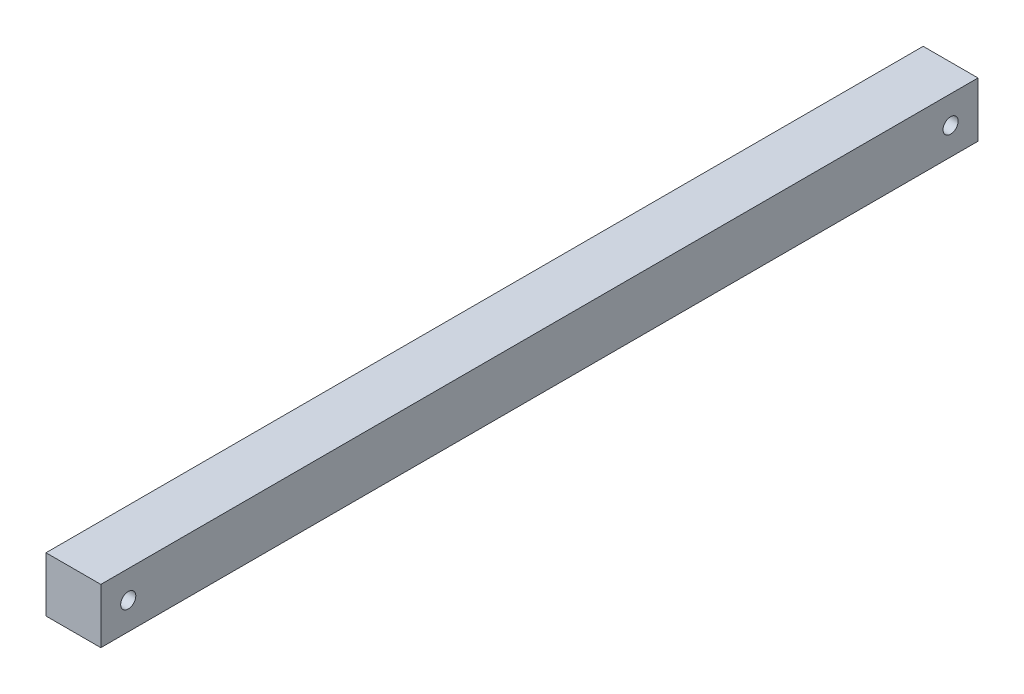
ISO-10303-21;
HEADER;
FILE_DESCRIPTION(('STEP AP214'),'2;1');
FILE_NAME('part.step','',(''),(''),'','','');
FILE_SCHEMA(('AUTOMOTIVE_DESIGN { 1 0 10303 214 1 1 1 1 }'));
ENDSEC;
DATA;
#1=APPLICATION_CONTEXT('core data for automotive mechanical design processes');
#2=APPLICATION_PROTOCOL_DEFINITION('international standard','automotive_design',2000,#1);
#3=PRODUCT_CONTEXT('',#1,'mechanical');
#4=PRODUCT('Part','Part','',(#3));
#5=PRODUCT_RELATED_PRODUCT_CATEGORY('part','',(#4));
#6=PRODUCT_DEFINITION_FORMATION('','',#4);
#7=PRODUCT_DEFINITION_CONTEXT('part definition',#1,'design');
#8=PRODUCT_DEFINITION('design','',#6,#7);
#9=PRODUCT_DEFINITION_SHAPE('','',#8);
#10=(LENGTH_UNIT() NAMED_UNIT(*) SI_UNIT(.MILLI.,.METRE.));
#11=(NAMED_UNIT(*) PLANE_ANGLE_UNIT() SI_UNIT($,.RADIAN.));
#12=(NAMED_UNIT(*) SI_UNIT($,.STERADIAN.) SOLID_ANGLE_UNIT());
#13=UNCERTAINTY_MEASURE_WITH_UNIT(LENGTH_MEASURE(1.E-05),#10,'distance_accuracy_value','');
#14=(GEOMETRIC_REPRESENTATION_CONTEXT(3) GLOBAL_UNCERTAINTY_ASSIGNED_CONTEXT((#13)) GLOBAL_UNIT_ASSIGNED_CONTEXT((#10,
#11,#12)) REPRESENTATION_CONTEXT('',''));
#15=CARTESIAN_POINT('',(0.,0.,0.));
#16=DIRECTION('',(0.,0.,1.));
#17=DIRECTION('',(1.,0.,0.));
#18=AXIS2_PLACEMENT_3D('',#15,#16,#17);
#19=CARTESIAN_POINT('',(12.7,-12.7,406.4));
#20=DIRECTION('',(-1.,0.,0.));
#21=DIRECTION('',(0.,0.,1.));
#22=AXIS2_PLACEMENT_3D('',#19,#20,#21);
#23=PLANE('',#22);
#24=CARTESIAN_POINT('',(12.7,0.,393.7));
#25=DIRECTION('',(-1.,0.,0.));
#26=DIRECTION('',(0.,0.,1.));
#27=AXIS2_PLACEMENT_3D('',#24,#25,#26);
#28=CIRCLE('',#27,3.50000000000002);
#29=CARTESIAN_POINT('',(12.7,0.,397.2));
#30=VERTEX_POINT('',#29);
#31=EDGE_CURVE('E111',#30,#30,#28,.T.);
#32=ORIENTED_EDGE('',*,*,#31,.T.);
#33=EDGE_LOOP('',(#32));
#34=FACE_BOUND('',#33,.T.);
#35=CARTESIAN_POINT('',(12.7,0.,12.7));
#36=DIRECTION('',(-1.,0.,0.));
#37=DIRECTION('',(0.,0.,-1.));
#38=AXIS2_PLACEMENT_3D('',#35,#36,#37);
#39=CIRCLE('',#38,3.50000000000003);
#40=CARTESIAN_POINT('',(12.7,0.,9.19999999999996));
#41=VERTEX_POINT('',#40);
#42=EDGE_CURVE('E132',#41,#41,#39,.T.);
#43=ORIENTED_EDGE('',*,*,#42,.T.);
#44=EDGE_LOOP('',(#43));
#45=FACE_BOUND('',#44,.T.);
#46=DIRECTION('',(0.,1.,0.));
#47=VECTOR('',#46,1.);
#48=CARTESIAN_POINT('',(12.7,-12.7,0.));
#49=LINE('',#48,#47);
#50=CARTESIAN_POINT('',(12.7,-12.7,0.));
#51=VERTEX_POINT('',#50);
#52=CARTESIAN_POINT('',(12.7,12.7,0.));
#53=VERTEX_POINT('',#52);
#54=EDGE_CURVE('E107',#51,#53,#49,.T.);
#55=ORIENTED_EDGE('',*,*,#54,.T.);
#56=DIRECTION('',(0.,0.,-1.));
#57=VECTOR('',#56,1.);
#58=CARTESIAN_POINT('',(12.7,12.7,406.4));
#59=LINE('',#58,#57);
#60=CARTESIAN_POINT('',(12.7,12.7,406.4));
#61=VERTEX_POINT('',#60);
#62=EDGE_CURVE('E11',#61,#53,#59,.T.);
#63=ORIENTED_EDGE('',*,*,#62,.F.);
#64=DIRECTION('',(0.,1.,0.));
#65=VECTOR('',#64,1.);
#66=CARTESIAN_POINT('',(12.7,-12.7,406.4));
#67=LINE('',#66,#65);
#68=CARTESIAN_POINT('',(12.7,-12.7,406.4));
#69=VERTEX_POINT('',#68);
#70=EDGE_CURVE('E91',#69,#61,#67,.T.);
#71=ORIENTED_EDGE('',*,*,#70,.F.);
#72=DIRECTION('',(0.,0.,-1.));
#73=VECTOR('',#72,1.);
#74=CARTESIAN_POINT('',(12.7,-12.7,406.4));
#75=LINE('',#74,#73);
#76=EDGE_CURVE('E103',#69,#51,#75,.T.);
#77=ORIENTED_EDGE('',*,*,#76,.T.);
#78=EDGE_LOOP('',(#55,#63,#71,#77));
#79=FACE_BOUND('',#78,.T.);
#80=ADVANCED_FACE('F39',(#34,#45,#79),#23,.F.);
#81=CARTESIAN_POINT('',(-12.7,12.7,406.4));
#82=DIRECTION('',(0.,-1.,0.));
#83=DIRECTION('',(0.,0.,-1.));
#84=AXIS2_PLACEMENT_3D('',#81,#82,#83);
#85=PLANE('',#84);
#86=DIRECTION('',(-1.,0.,0.));
#87=VECTOR('',#86,1.);
#88=CARTESIAN_POINT('',(-12.7,12.7,0.));
#89=LINE('',#88,#87);
#90=CARTESIAN_POINT('',(-12.7,12.7,0.));
#91=VERTEX_POINT('',#90);
#92=EDGE_CURVE('E96',#53,#91,#89,.T.);
#93=ORIENTED_EDGE('',*,*,#92,.T.);
#94=DIRECTION('',(0.,0.,-1.));
#95=VECTOR('',#94,1.);
#96=CARTESIAN_POINT('',(-12.7,12.7,406.4));
#97=LINE('',#96,#95);
#98=CARTESIAN_POINT('',(-12.7,12.7,406.4));
#99=VERTEX_POINT('',#98);
#100=EDGE_CURVE('E48',#99,#91,#97,.T.);
#101=ORIENTED_EDGE('',*,*,#100,.F.);
#102=DIRECTION('',(-1.,0.,0.));
#103=VECTOR('',#102,1.);
#104=CARTESIAN_POINT('',(-12.7,12.7,406.4));
#105=LINE('',#104,#103);
#106=EDGE_CURVE('E86',#61,#99,#105,.T.);
#107=ORIENTED_EDGE('',*,*,#106,.F.);
#108=ORIENTED_EDGE('',*,*,#62,.T.);
#109=EDGE_LOOP('',(#93,#101,#107,#108));
#110=FACE_BOUND('',#109,.T.);
#111=ADVANCED_FACE('F95',(#110),#85,.F.);
#112=CARTESIAN_POINT('',(-12.7,-12.7,406.4));
#113=DIRECTION('',(1.,0.,0.));
#114=DIRECTION('',(0.,0.,-1.));
#115=AXIS2_PLACEMENT_3D('',#112,#113,#114);
#116=PLANE('',#115);
#117=CARTESIAN_POINT('',(-12.7,0.,393.7));
#118=DIRECTION('',(-1.,0.,0.));
#119=DIRECTION('',(0.,0.,1.));
#120=AXIS2_PLACEMENT_3D('',#117,#118,#119);
#121=CIRCLE('',#120,3.50000000000002);
#122=CARTESIAN_POINT('',(-12.7,0.,397.2));
#123=VERTEX_POINT('',#122);
#124=EDGE_CURVE('E136',#123,#123,#121,.T.);
#125=ORIENTED_EDGE('',*,*,#124,.F.);
#126=EDGE_LOOP('',(#125));
#127=FACE_BOUND('',#126,.T.);
#128=CARTESIAN_POINT('',(-12.7,0.,12.7));
#129=DIRECTION('',(-1.,0.,0.));
#130=DIRECTION('',(0.,0.,-1.));
#131=AXIS2_PLACEMENT_3D('',#128,#129,#130);
#132=CIRCLE('',#131,3.50000000000003);
#133=CARTESIAN_POINT('',(-12.7,0.,9.19999999999996));
#134=VERTEX_POINT('',#133);
#135=EDGE_CURVE('E128',#134,#134,#132,.T.);
#136=ORIENTED_EDGE('',*,*,#135,.F.);
#137=EDGE_LOOP('',(#136));
#138=FACE_BOUND('',#137,.T.);
#139=DIRECTION('',(0.,-1.,0.));
#140=VECTOR('',#139,1.);
#141=CARTESIAN_POINT('',(-12.7,-12.7,0.));
#142=LINE('',#141,#140);
#143=CARTESIAN_POINT('',(-12.7,-12.7,0.));
#144=VERTEX_POINT('',#143);
#145=EDGE_CURVE('E73',#91,#144,#142,.T.);
#146=ORIENTED_EDGE('',*,*,#145,.T.);
#147=DIRECTION('',(0.,0.,-1.));
#148=VECTOR('',#147,1.);
#149=CARTESIAN_POINT('',(-12.7,-12.7,406.4));
#150=LINE('',#149,#148);
#151=CARTESIAN_POINT('',(-12.7,-12.7,406.4));
#152=VERTEX_POINT('',#151);
#153=EDGE_CURVE('E98',#152,#144,#150,.T.);
#154=ORIENTED_EDGE('',*,*,#153,.F.);
#155=DIRECTION('',(0.,-1.,0.));
#156=VECTOR('',#155,1.);
#157=CARTESIAN_POINT('',(-12.7,-12.7,406.4));
#158=LINE('',#157,#156);
#159=EDGE_CURVE('E89',#99,#152,#158,.T.);
#160=ORIENTED_EDGE('',*,*,#159,.F.);
#161=ORIENTED_EDGE('',*,*,#100,.T.);
#162=EDGE_LOOP('',(#146,#154,#160,#161));
#163=FACE_BOUND('',#162,.T.);
#164=ADVANCED_FACE('F99',(#127,#138,#163),#116,.F.);
#165=CARTESIAN_POINT('',(-12.7,-12.7,406.4));
#166=DIRECTION('',(0.,1.,0.));
#167=DIRECTION('',(0.,0.,1.));
#168=AXIS2_PLACEMENT_3D('',#165,#166,#167);
#169=PLANE('',#168);
#170=DIRECTION('',(1.,0.,0.));
#171=VECTOR('',#170,1.);
#172=CARTESIAN_POINT('',(-12.7,-12.7,0.));
#173=LINE('',#172,#171);
#174=EDGE_CURVE('E79',#144,#51,#173,.T.);
#175=ORIENTED_EDGE('',*,*,#174,.T.);
#176=ORIENTED_EDGE('',*,*,#76,.F.);
#177=DIRECTION('',(1.,0.,0.));
#178=VECTOR('',#177,1.);
#179=CARTESIAN_POINT('',(-12.7,-12.7,406.4));
#180=LINE('',#179,#178);
#181=EDGE_CURVE('E56',#152,#69,#180,.T.);
#182=ORIENTED_EDGE('',*,*,#181,.F.);
#183=ORIENTED_EDGE('',*,*,#153,.T.);
#184=EDGE_LOOP('',(#175,#176,#182,#183));
#185=FACE_BOUND('',#184,.T.);
#186=ADVANCED_FACE('F121',(#185),#169,.F.);
#187=CARTESIAN_POINT('',(0.,0.,406.4));
#188=DIRECTION('',(0.,0.,-1.));
#189=DIRECTION('',(-1.,0.,0.));
#190=AXIS2_PLACEMENT_3D('',#187,#188,#189);
#191=PLANE('',#190);
#192=ORIENTED_EDGE('',*,*,#70,.T.);
#193=ORIENTED_EDGE('',*,*,#106,.T.);
#194=ORIENTED_EDGE('',*,*,#159,.T.);
#195=ORIENTED_EDGE('',*,*,#181,.T.);
#196=EDGE_LOOP('',(#192,#193,#194,#195));
#197=FACE_BOUND('',#196,.T.);
#198=ADVANCED_FACE('F87',(#197),#191,.F.);
#199=CARTESIAN_POINT('',(0.,0.,0.));
#200=DIRECTION('',(0.,0.,-1.));
#201=DIRECTION('',(-1.,0.,0.));
#202=AXIS2_PLACEMENT_3D('',#199,#200,#201);
#203=PLANE('',#202);
#204=ORIENTED_EDGE('',*,*,#54,.F.);
#205=ORIENTED_EDGE('',*,*,#174,.F.);
#206=ORIENTED_EDGE('',*,*,#145,.F.);
#207=ORIENTED_EDGE('',*,*,#92,.F.);
#208=EDGE_LOOP('',(#204,#205,#206,#207));
#209=FACE_BOUND('',#208,.T.);
#210=ADVANCED_FACE('F124',(#209),#203,.T.);
#211=CARTESIAN_POINT('',(12.7,0.,12.7));
#212=DIRECTION('',(-1.,0.,0.));
#213=DIRECTION('',(0.,0.,1.));
#214=AXIS2_PLACEMENT_3D('',#211,#212,#213);
#215=CYLINDRICAL_SURFACE('',#214,3.50000000000003);
#216=ORIENTED_EDGE('',*,*,#42,.F.);
#217=EDGE_LOOP('',(#216));
#218=FACE_BOUND('',#217,.T.);
#219=ORIENTED_EDGE('',*,*,#135,.T.);
#220=EDGE_LOOP('',(#219));
#221=FACE_BOUND('',#220,.T.);
#222=ADVANCED_FACE('F149',(#218,#221),#215,.F.);
#223=CARTESIAN_POINT('',(12.7,0.,393.7));
#224=DIRECTION('',(-1.,0.,0.));
#225=DIRECTION('',(0.,0.,1.));
#226=AXIS2_PLACEMENT_3D('',#223,#224,#225);
#227=CYLINDRICAL_SURFACE('',#226,3.50000000000002);
#228=ORIENTED_EDGE('',*,*,#31,.F.);
#229=EDGE_LOOP('',(#228));
#230=FACE_BOUND('',#229,.T.);
#231=ORIENTED_EDGE('',*,*,#124,.T.);
#232=EDGE_LOOP('',(#231));
#233=FACE_BOUND('',#232,.T.);
#234=ADVANCED_FACE('F146',(#230,#233),#227,.F.);
#235=CLOSED_SHELL('',(#80,#111,#164,#186,#198,#210,#222,#234));
#236=MANIFOLD_SOLID_BREP('B2',#235);
#237=ADVANCED_BREP_SHAPE_REPRESENTATION('',(#18,#236),#14);
#238=SHAPE_DEFINITION_REPRESENTATION(#9,#237);
ENDSEC;
END-ISO-10303-21;
